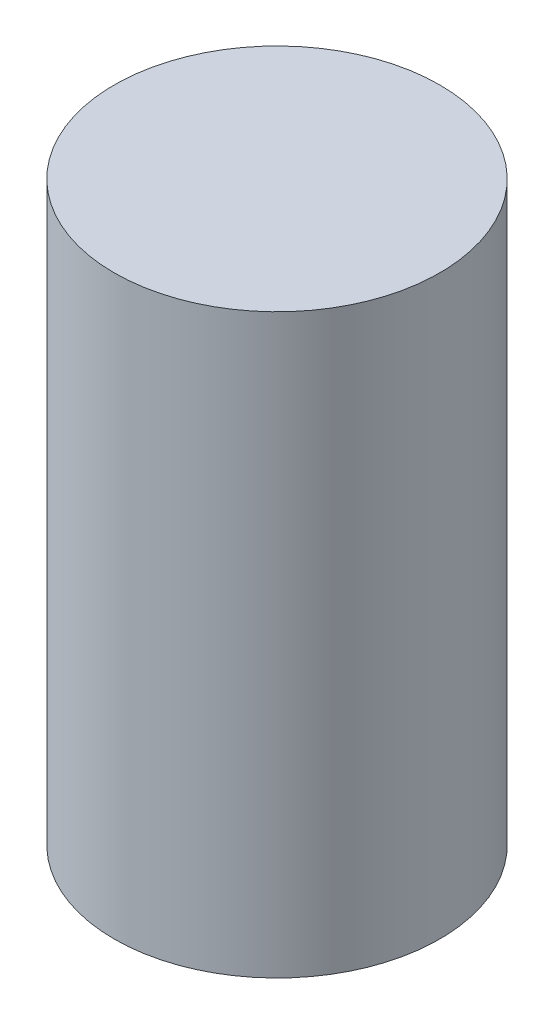
ISO-10303-21;
HEADER;
FILE_DESCRIPTION(('STEP AP214'),'2;1');
FILE_NAME('part.step','',(''),(''),'','','');
FILE_SCHEMA(('AUTOMOTIVE_DESIGN { 1 0 10303 214 1 1 1 1 }'));
ENDSEC;
DATA;
#1=APPLICATION_CONTEXT('core data for automotive mechanical design processes');
#2=APPLICATION_PROTOCOL_DEFINITION('international standard','automotive_design',2000,#1);
#3=PRODUCT_CONTEXT('',#1,'mechanical');
#4=PRODUCT('Part','Part','',(#3));
#5=PRODUCT_RELATED_PRODUCT_CATEGORY('part','',(#4));
#6=PRODUCT_DEFINITION_FORMATION('','',#4);
#7=PRODUCT_DEFINITION_CONTEXT('part definition',#1,'design');
#8=PRODUCT_DEFINITION('design','',#6,#7);
#9=PRODUCT_DEFINITION_SHAPE('','',#8);
#10=(LENGTH_UNIT() NAMED_UNIT(*) SI_UNIT(.MILLI.,.METRE.));
#11=(NAMED_UNIT(*) PLANE_ANGLE_UNIT() SI_UNIT($,.RADIAN.));
#12=(NAMED_UNIT(*) SI_UNIT($,.STERADIAN.) SOLID_ANGLE_UNIT());
#13=UNCERTAINTY_MEASURE_WITH_UNIT(LENGTH_MEASURE(1.E-05),#10,'distance_accuracy_value','');
#14=(GEOMETRIC_REPRESENTATION_CONTEXT(3) GLOBAL_UNCERTAINTY_ASSIGNED_CONTEXT((#13)) GLOBAL_UNIT_ASSIGNED_CONTEXT((#10,
#11,#12)) REPRESENTATION_CONTEXT('',''));
#15=CARTESIAN_POINT('',(0.,0.,0.));
#16=DIRECTION('',(0.,0.,1.));
#17=DIRECTION('',(1.,0.,0.));
#18=AXIS2_PLACEMENT_3D('',#15,#16,#17);
#19=CARTESIAN_POINT('',(0.,162.052,0.));
#20=DIRECTION('',(0.,-1.,0.));
#21=DIRECTION('',(0.,0.,-1.));
#22=AXIS2_PLACEMENT_3D('',#19,#20,#21);
#23=CYLINDRICAL_SURFACE('',#22,45.72);
#24=CARTESIAN_POINT('',(0.,162.052,0.));
#25=DIRECTION('',(0.,1.,0.));
#26=DIRECTION('',(0.,0.,1.));
#27=AXIS2_PLACEMENT_3D('',#24,#25,#26);
#28=CIRCLE('',#27,45.72);
#29=CARTESIAN_POINT('',(0.,162.052,45.72));
#30=VERTEX_POINT('',#29);
#31=EDGE_CURVE('E10',#30,#30,#28,.T.);
#32=ORIENTED_EDGE('',*,*,#31,.F.);
#33=EDGE_LOOP('',(#32));
#34=FACE_BOUND('',#33,.T.);
#35=CARTESIAN_POINT('',(0.,0.,0.));
#36=DIRECTION('',(0.,1.,0.));
#37=DIRECTION('',(0.,0.,1.));
#38=AXIS2_PLACEMENT_3D('',#35,#36,#37);
#39=CIRCLE('',#38,45.72);
#40=CARTESIAN_POINT('',(0.,0.,45.72));
#41=VERTEX_POINT('',#40);
#42=EDGE_CURVE('E33',#41,#41,#39,.T.);
#43=ORIENTED_EDGE('',*,*,#42,.T.);
#44=EDGE_LOOP('',(#43));
#45=FACE_BOUND('',#44,.T.);
#46=ADVANCED_FACE('F30',(#34,#45),#23,.T.);
#47=CARTESIAN_POINT('',(0.,162.052,0.));
#48=DIRECTION('',(0.,1.,0.));
#49=DIRECTION('',(0.,0.,1.));
#50=AXIS2_PLACEMENT_3D('',#47,#48,#49);
#51=PLANE('',#50);
#52=ORIENTED_EDGE('',*,*,#31,.T.);
#53=EDGE_LOOP('',(#52));
#54=FACE_BOUND('',#53,.T.);
#55=ADVANCED_FACE('F45',(#54),#51,.T.);
#56=CARTESIAN_POINT('',(0.,0.,0.));
#57=DIRECTION('',(0.,1.,0.));
#58=DIRECTION('',(0.,0.,1.));
#59=AXIS2_PLACEMENT_3D('',#56,#57,#58);
#60=PLANE('',#59);
#61=ORIENTED_EDGE('',*,*,#42,.F.);
#62=EDGE_LOOP('',(#61));
#63=FACE_BOUND('',#62,.T.);
#64=ADVANCED_FACE('F43',(#63),#60,.F.);
#65=CLOSED_SHELL('',(#46,#55,#64));
#66=MANIFOLD_SOLID_BREP('B2',#65);
#67=ADVANCED_BREP_SHAPE_REPRESENTATION('',(#18,#66),#14);
#68=SHAPE_DEFINITION_REPRESENTATION(#9,#67);
ENDSEC;
END-ISO-10303-21;
